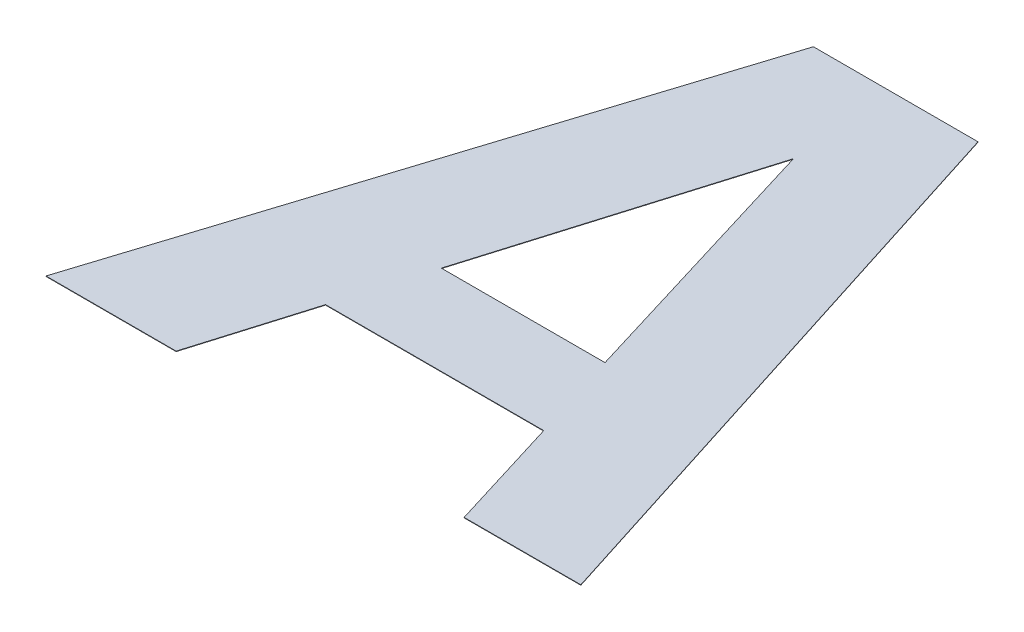
ISO-10303-21;
HEADER;
FILE_DESCRIPTION(('STEP AP214'),'2;1');
FILE_NAME('part.step','',(''),(''),'','','');
FILE_SCHEMA(('AUTOMOTIVE_DESIGN { 1 0 10303 214 1 1 1 1 }'));
ENDSEC;
DATA;
#1=APPLICATION_CONTEXT('core data for automotive mechanical design processes');
#2=APPLICATION_PROTOCOL_DEFINITION('international standard','automotive_design',2000,#1);
#3=PRODUCT_CONTEXT('',#1,'mechanical');
#4=PRODUCT('Part','Part','',(#3));
#5=PRODUCT_RELATED_PRODUCT_CATEGORY('part','',(#4));
#6=PRODUCT_DEFINITION_FORMATION('','',#4);
#7=PRODUCT_DEFINITION_CONTEXT('part definition',#1,'design');
#8=PRODUCT_DEFINITION('design','',#6,#7);
#9=PRODUCT_DEFINITION_SHAPE('','',#8);
#10=(LENGTH_UNIT() NAMED_UNIT(*) SI_UNIT(.MILLI.,.METRE.));
#11=(NAMED_UNIT(*) PLANE_ANGLE_UNIT() SI_UNIT($,.RADIAN.));
#12=(NAMED_UNIT(*) SI_UNIT($,.STERADIAN.) SOLID_ANGLE_UNIT());
#13=UNCERTAINTY_MEASURE_WITH_UNIT(LENGTH_MEASURE(1.E-05),#10,'distance_accuracy_value','');
#14=(GEOMETRIC_REPRESENTATION_CONTEXT(3) GLOBAL_UNCERTAINTY_ASSIGNED_CONTEXT((#13)) GLOBAL_UNIT_ASSIGNED_CONTEXT((#10,
#11,#12)) REPRESENTATION_CONTEXT('',''));
#15=CARTESIAN_POINT('',(0.,0.,0.));
#16=DIRECTION('',(0.,0.,1.));
#17=DIRECTION('',(1.,0.,0.));
#18=AXIS2_PLACEMENT_3D('',#15,#16,#17);
#19=CARTESIAN_POINT('',(26.67,0.00300000000000009,0.));
#20=DIRECTION('',(0.,1.,0.));
#21=DIRECTION('',(0.,0.,1.));
#22=AXIS2_PLACEMENT_3D('',#19,#20,#21);
#23=PLANE('',#22);
#24=DIRECTION('',(-0.290938970277883,0.,-0.956741613798441));
#25=VECTOR('',#24,1.);
#26=CARTESIAN_POINT('',(19.2164156567885,0.00300000000000009,-83.618416758954));
#27=LINE('',#26,#25);
#28=CARTESIAN_POINT('',(19.2164156567885,0.00300000000000009,-83.618416758954));
#29=VERTEX_POINT('',#28);
#30=CARTESIAN_POINT('',(19.4993446978223,0.00300000000000009,-82.6880154894006));
#31=VERTEX_POINT('',#30);
#32=EDGE_CURVE('E121',#29,#31,#27,.F.);
#33=ORIENTED_EDGE('',*,*,#32,.T.);
#34=DIRECTION('',(1.,0.,0.));
#35=VECTOR('',#34,1.);
#36=CARTESIAN_POINT('',(19.4993446978223,0.00300000000000009,-82.6880154894006));
#37=LINE('',#36,#35);
#38=CARTESIAN_POINT('',(18.9371139111526,0.00300000000000009,-82.6880154894006));
#39=VERTEX_POINT('',#38);
#40=EDGE_CURVE('E162',#31,#39,#37,.F.);
#41=ORIENTED_EDGE('',*,*,#40,.T.);
#42=DIRECTION('',(-0.287519166070125,0.,0.957774884376459));
#43=VECTOR('',#42,1.);
#44=CARTESIAN_POINT('',(18.9371139111526,0.00300000000000009,-82.6880154894006));
#45=LINE('',#44,#43);
#46=EDGE_CURVE('E158',#39,#29,#45,.F.);
#47=ORIENTED_EDGE('',*,*,#46,.T.);
#48=EDGE_LOOP('',(#33,#41,#47));
#49=FACE_BOUND('',#48,.T.);
#50=DIRECTION('',(1.,0.,0.));
#51=VECTOR('',#50,1.);
#52=CARTESIAN_POINT('',(19.4830218685319,0.00300000000000009,-83.9856804179882));
#53=LINE('',#52,#51);
#54=CARTESIAN_POINT('',(19.4830218685319,0.00300000000000009,-83.9856804179882));
#55=VERTEX_POINT('',#54);
#56=CARTESIAN_POINT('',(18.9176171983891,0.00300000000000009,-83.9856804179882));
#57=VERTEX_POINT('',#56);
#58=EDGE_CURVE('E136',#55,#57,#53,.F.);
#59=ORIENTED_EDGE('',*,*,#58,.T.);
#60=DIRECTION('',(0.303105565746836,0.,-0.952956985395086));
#61=VECTOR('',#60,1.);
#62=CARTESIAN_POINT('',(18.9176171983891,0.00300000000000009,-83.9856804179882));
#63=LINE('',#62,#61);
#64=CARTESIAN_POINT('',(18.2814802679878,0.00300000000000009,-81.9856804179882));
#65=VERTEX_POINT('',#64);
#66=EDGE_CURVE('E127',#57,#65,#63,.F.);
#67=ORIENTED_EDGE('',*,*,#66,.T.);
#68=DIRECTION('',(-1.,0.,0.));
#69=VECTOR('',#68,1.);
#70=CARTESIAN_POINT('',(18.2814802679878,0.00300000000000009,-81.9856804179882));
#71=LINE('',#70,#69);
#72=CARTESIAN_POINT('',(18.7285444257751,0.00300000000000009,-81.9856804179882));
#73=VERTEX_POINT('',#72);
#74=EDGE_CURVE('E164',#65,#73,#71,.F.);
#75=ORIENTED_EDGE('',*,*,#74,.T.);
#76=DIRECTION('',(-0.287045176736179,0.,0.957917045736475));
#77=VECTOR('',#76,1.);
#78=CARTESIAN_POINT('',(18.7285444257751,0.00300000000000009,-81.9856804179882));
#79=LINE('',#78,#77);
#80=CARTESIAN_POINT('',(18.8468849381306,0.00300000000000009,-82.3806022044312));
#81=VERTEX_POINT('',#80);
#82=EDGE_CURVE('E102',#73,#81,#79,.F.);
#83=ORIENTED_EDGE('',*,*,#82,.T.);
#84=DIRECTION('',(-1.,0.,0.));
#85=VECTOR('',#84,1.);
#86=CARTESIAN_POINT('',(18.8468849381306,0.00300000000000009,-82.3806022044312));
#87=LINE('',#86,#85);
#88=CARTESIAN_POINT('',(19.5963748497153,0.00300000000000009,-82.3806022044312));
#89=VERTEX_POINT('',#88);
#90=EDGE_CURVE('E99',#81,#89,#87,.F.);
#91=ORIENTED_EDGE('',*,*,#90,.T.);
#92=DIRECTION('',(-0.294085848837518,0.,-0.955779008721952));
#93=VECTOR('',#92,1.);
#94=CARTESIAN_POINT('',(19.5963748497153,0.00300000000000009,-82.3806022044312));
#95=LINE('',#94,#93);
#96=CARTESIAN_POINT('',(19.7178892455439,0.00300000000000009,-81.9856804179882));
#97=VERTEX_POINT('',#96);
#98=EDGE_CURVE('E151',#89,#97,#95,.F.);
#99=ORIENTED_EDGE('',*,*,#98,.T.);
#100=DIRECTION('',(-1.,0.,0.));
#101=VECTOR('',#100,1.);
#102=CARTESIAN_POINT('',(19.7178892455439,0.00300000000000009,-81.9856804179882));
#103=LINE('',#102,#101);
#104=CARTESIAN_POINT('',(20.1187053870084,0.00300000000000009,-81.9856804179882));
#105=VERTEX_POINT('',#104);
#106=EDGE_CURVE('E147',#97,#105,#103,.F.);
#107=ORIENTED_EDGE('',*,*,#106,.T.);
#108=DIRECTION('',(0.30290935378198,0.,0.953019371991663));
#109=VECTOR('',#108,1.);
#110=CARTESIAN_POINT('',(20.1187053870084,0.00300000000000009,-81.9856804179882));
#111=LINE('',#110,#109);
#112=EDGE_CURVE('E142',#105,#55,#111,.F.);
#113=ORIENTED_EDGE('',*,*,#112,.T.);
#114=EDGE_LOOP('',(#59,#67,#75,#83,#91,#99,#107,#113));
#115=FACE_BOUND('',#114,.T.);
#116=ADVANCED_FACE('F16',(#49,#115),#23,.T.);
#117=CARTESIAN_POINT('',(18.7285444257751,0.00300000000000009,-81.9856804179882));
#118=DIRECTION('',(-0.957917045736475,0.,-0.287045176736179));
#119=DIRECTION('',(-0.287045176736179,0.,0.957917045736475));
#120=AXIS2_PLACEMENT_3D('',#117,#118,#119);
#121=PLANE('',#120);
#122=DIRECTION('',(0.,1.,0.));
#123=VECTOR('',#122,1.);
#124=CARTESIAN_POINT('',(18.8468849381306,0.00300000000000009,-82.3806022044312));
#125=LINE('',#124,#123);
#126=CARTESIAN_POINT('',(18.8468849381306,0.00149999999999997,-82.3806022044312));
#127=VERTEX_POINT('',#126);
#128=EDGE_CURVE('E19',#127,#81,#125,.T.);
#129=ORIENTED_EDGE('',*,*,#128,.T.);
#130=ORIENTED_EDGE('',*,*,#82,.F.);
#131=DIRECTION('',(0.,1.,0.));
#132=VECTOR('',#131,1.);
#133=CARTESIAN_POINT('',(18.7285444257751,0.00300000000000009,-81.9856804179882));
#134=LINE('',#133,#132);
#135=CARTESIAN_POINT('',(18.7285444257751,0.00149999999999997,-81.9856804179882));
#136=VERTEX_POINT('',#135);
#137=EDGE_CURVE('E116',#73,#136,#134,.F.);
#138=ORIENTED_EDGE('',*,*,#137,.T.);
#139=DIRECTION('',(0.287045176736224,0.,-0.957917045736461));
#140=VECTOR('',#139,1.);
#141=CARTESIAN_POINT('',(18.7285444257751,0.00149999999999997,-81.9856804179882));
#142=LINE('',#141,#140);
#143=EDGE_CURVE('E108',#136,#127,#142,.T.);
#144=ORIENTED_EDGE('',*,*,#143,.T.);
#145=EDGE_LOOP('',(#129,#130,#138,#144));
#146=FACE_BOUND('',#145,.T.);
#147=ADVANCED_FACE('F114',(#146),#121,.F.);
#148=CARTESIAN_POINT('',(18.8468849381306,0.00300000000000009,-82.3806022044312));
#149=DIRECTION('',(0.,0.,-1.));
#150=DIRECTION('',(-1.,0.,0.));
#151=AXIS2_PLACEMENT_3D('',#148,#149,#150);
#152=PLANE('',#151);
#153=DIRECTION('',(0.,1.,0.));
#154=VECTOR('',#153,1.);
#155=CARTESIAN_POINT('',(19.5963748497153,0.00300000000000009,-82.3806022044312));
#156=LINE('',#155,#154);
#157=CARTESIAN_POINT('',(19.5963748497153,0.00149999999999997,-82.3806022044312));
#158=VERTEX_POINT('',#157);
#159=EDGE_CURVE('E152',#158,#89,#156,.T.);
#160=ORIENTED_EDGE('',*,*,#159,.T.);
#161=ORIENTED_EDGE('',*,*,#90,.F.);
#162=ORIENTED_EDGE('',*,*,#128,.F.);
#163=DIRECTION('',(1.,0.,0.));
#164=VECTOR('',#163,1.);
#165=CARTESIAN_POINT('',(26.67,0.00149999999999997,-82.3806022044312));
#166=LINE('',#165,#164);
#167=EDGE_CURVE('E98',#127,#158,#166,.T.);
#168=ORIENTED_EDGE('',*,*,#167,.T.);
#169=EDGE_LOOP('',(#160,#161,#162,#168));
#170=FACE_BOUND('',#169,.T.);
#171=ADVANCED_FACE('F97',(#170),#152,.F.);
#172=CARTESIAN_POINT('',(19.5963748497153,0.00300000000000009,-82.3806022044312));
#173=DIRECTION('',(0.955779008721952,0.,-0.294085848837518));
#174=DIRECTION('',(-0.294085848837518,0.,-0.955779008721952));
#175=AXIS2_PLACEMENT_3D('',#172,#173,#174);
#176=PLANE('',#175);
#177=DIRECTION('',(0.,1.,0.));
#178=VECTOR('',#177,1.);
#179=CARTESIAN_POINT('',(19.7178892455439,0.00300000000000009,-81.9856804179882));
#180=LINE('',#179,#178);
#181=CARTESIAN_POINT('',(19.7178892455439,0.00149999999999997,-81.9856804179882));
#182=VERTEX_POINT('',#181);
#183=EDGE_CURVE('E149',#182,#97,#180,.T.);
#184=ORIENTED_EDGE('',*,*,#183,.T.);
#185=ORIENTED_EDGE('',*,*,#98,.F.);
#186=ORIENTED_EDGE('',*,*,#159,.F.);
#187=DIRECTION('',(0.294085848837486,0.,0.955779008721962));
#188=VECTOR('',#187,1.);
#189=CARTESIAN_POINT('',(19.5963748497153,0.00149999999999997,-82.3806022044312));
#190=LINE('',#189,#188);
#191=EDGE_CURVE('E112',#158,#182,#190,.T.);
#192=ORIENTED_EDGE('',*,*,#191,.T.);
#193=EDGE_LOOP('',(#184,#185,#186,#192));
#194=FACE_BOUND('',#193,.T.);
#195=ADVANCED_FACE('F176',(#194),#176,.F.);
#196=CARTESIAN_POINT('',(19.7178892455439,0.00300000000000009,-81.9856804179882));
#197=DIRECTION('',(0.,0.,-1.));
#198=DIRECTION('',(-1.,0.,0.));
#199=AXIS2_PLACEMENT_3D('',#196,#197,#198);
#200=PLANE('',#199);
#201=DIRECTION('',(0.,1.,0.));
#202=VECTOR('',#201,1.);
#203=CARTESIAN_POINT('',(20.1187053870084,0.00300000000000009,-81.9856804179882));
#204=LINE('',#203,#202);
#205=CARTESIAN_POINT('',(20.1187053870084,0.00149999999999997,-81.9856804179882));
#206=VERTEX_POINT('',#205);
#207=EDGE_CURVE('E144',#206,#105,#204,.T.);
#208=ORIENTED_EDGE('',*,*,#207,.T.);
#209=ORIENTED_EDGE('',*,*,#106,.F.);
#210=ORIENTED_EDGE('',*,*,#183,.F.);
#211=DIRECTION('',(1.,0.,0.));
#212=VECTOR('',#211,1.);
#213=CARTESIAN_POINT('',(26.67,0.00149999999999997,-81.9856804179882));
#214=LINE('',#213,#212);
#215=EDGE_CURVE('E141',#182,#206,#214,.T.);
#216=ORIENTED_EDGE('',*,*,#215,.T.);
#217=EDGE_LOOP('',(#208,#209,#210,#216));
#218=FACE_BOUND('',#217,.T.);
#219=ADVANCED_FACE('F181',(#218),#200,.F.);
#220=CARTESIAN_POINT('',(20.1187053870084,0.00300000000000009,-81.9856804179882));
#221=DIRECTION('',(-0.953019371991663,0.,0.30290935378198));
#222=DIRECTION('',(0.30290935378198,0.,0.953019371991663));
#223=AXIS2_PLACEMENT_3D('',#220,#221,#222);
#224=PLANE('',#223);
#225=DIRECTION('',(0.,1.,0.));
#226=VECTOR('',#225,1.);
#227=CARTESIAN_POINT('',(19.4830218685319,0.00300000000000009,-83.9856804179882));
#228=LINE('',#227,#226);
#229=CARTESIAN_POINT('',(19.4830218685319,0.00149999999999997,-83.9856804179882));
#230=VERTEX_POINT('',#229);
#231=EDGE_CURVE('E138',#230,#55,#228,.T.);
#232=ORIENTED_EDGE('',*,*,#231,.T.);
#233=ORIENTED_EDGE('',*,*,#112,.F.);
#234=ORIENTED_EDGE('',*,*,#207,.F.);
#235=DIRECTION('',(-0.302909353781965,0.,-0.953019371991667));
#236=VECTOR('',#235,1.);
#237=CARTESIAN_POINT('',(20.1187053870084,0.00149999999999997,-81.9856804179882));
#238=LINE('',#237,#236);
#239=EDGE_CURVE('E135',#206,#230,#238,.T.);
#240=ORIENTED_EDGE('',*,*,#239,.T.);
#241=EDGE_LOOP('',(#232,#233,#234,#240));
#242=FACE_BOUND('',#241,.T.);
#243=ADVANCED_FACE('F184',(#242),#224,.F.);
#244=CARTESIAN_POINT('',(19.4830218685319,0.00300000000000009,-83.9856804179882));
#245=DIRECTION('',(0.,0.,1.));
#246=DIRECTION('',(1.,0.,0.));
#247=AXIS2_PLACEMENT_3D('',#244,#245,#246);
#248=PLANE('',#247);
#249=DIRECTION('',(0.,1.,0.));
#250=VECTOR('',#249,1.);
#251=CARTESIAN_POINT('',(18.9176171983891,0.00300000000000009,-83.9856804179882));
#252=LINE('',#251,#250);
#253=CARTESIAN_POINT('',(18.9176171983891,0.00149999999999997,-83.9856804179882));
#254=VERTEX_POINT('',#253);
#255=EDGE_CURVE('E130',#254,#57,#252,.T.);
#256=ORIENTED_EDGE('',*,*,#255,.T.);
#257=ORIENTED_EDGE('',*,*,#58,.F.);
#258=ORIENTED_EDGE('',*,*,#231,.F.);
#259=DIRECTION('',(1.,0.,0.));
#260=VECTOR('',#259,1.);
#261=CARTESIAN_POINT('',(26.67,0.00149999999999997,-83.9856804179882));
#262=LINE('',#261,#260);
#263=EDGE_CURVE('E131',#230,#254,#262,.F.);
#264=ORIENTED_EDGE('',*,*,#263,.T.);
#265=EDGE_LOOP('',(#256,#257,#258,#264));
#266=FACE_BOUND('',#265,.T.);
#267=ADVANCED_FACE('F188',(#266),#248,.F.);
#268=CARTESIAN_POINT('',(18.9176171983891,0.00300000000000009,-83.9856804179882));
#269=DIRECTION('',(0.952956985395086,0.,0.303105565746836));
#270=DIRECTION('',(0.303105565746836,0.,-0.952956985395086));
#271=AXIS2_PLACEMENT_3D('',#268,#269,#270);
#272=PLANE('',#271);
#273=DIRECTION('',(0.,1.,0.));
#274=VECTOR('',#273,1.);
#275=CARTESIAN_POINT('',(18.2814802679878,0.00300000000000009,-81.9856804179882));
#276=LINE('',#275,#274);
#277=CARTESIAN_POINT('',(18.2814802679878,0.00149999999999997,-81.9856804179882));
#278=VERTEX_POINT('',#277);
#279=EDGE_CURVE('E129',#278,#65,#276,.T.);
#280=ORIENTED_EDGE('',*,*,#279,.T.);
#281=ORIENTED_EDGE('',*,*,#66,.F.);
#282=ORIENTED_EDGE('',*,*,#255,.F.);
#283=DIRECTION('',(-0.30310556574685,0.,0.952956985395082));
#284=VECTOR('',#283,1.);
#285=CARTESIAN_POINT('',(18.9176171983891,0.00149999999999997,-83.9856804179882));
#286=LINE('',#285,#284);
#287=EDGE_CURVE('E134',#254,#278,#286,.T.);
#288=ORIENTED_EDGE('',*,*,#287,.T.);
#289=EDGE_LOOP('',(#280,#281,#282,#288));
#290=FACE_BOUND('',#289,.T.);
#291=ADVANCED_FACE('F194',(#290),#272,.F.);
#292=CARTESIAN_POINT('',(18.2814802679878,0.00300000000000009,-81.9856804179882));
#293=DIRECTION('',(0.,0.,-1.));
#294=DIRECTION('',(-1.,0.,0.));
#295=AXIS2_PLACEMENT_3D('',#292,#293,#294);
#296=PLANE('',#295);
#297=ORIENTED_EDGE('',*,*,#137,.F.);
#298=ORIENTED_EDGE('',*,*,#74,.F.);
#299=ORIENTED_EDGE('',*,*,#279,.F.);
#300=DIRECTION('',(1.,0.,0.));
#301=VECTOR('',#300,1.);
#302=CARTESIAN_POINT('',(26.67,0.00149999999999997,-81.9856804179882));
#303=LINE('',#302,#301);
#304=EDGE_CURVE('E125',#278,#136,#303,.T.);
#305=ORIENTED_EDGE('',*,*,#304,.T.);
#306=EDGE_LOOP('',(#297,#298,#299,#305));
#307=FACE_BOUND('',#306,.T.);
#308=ADVANCED_FACE('F196',(#307),#296,.F.);
#309=CARTESIAN_POINT('',(19.4993446978223,0.00300000000000009,-82.6880154894006));
#310=DIRECTION('',(0.,0.,1.));
#311=DIRECTION('',(1.,0.,0.));
#312=AXIS2_PLACEMENT_3D('',#309,#310,#311);
#313=PLANE('',#312);
#314=DIRECTION('',(0.,1.,0.));
#315=VECTOR('',#314,1.);
#316=CARTESIAN_POINT('',(18.9371139111526,0.00300000000000009,-82.6880154894006));
#317=LINE('',#316,#315);
#318=CARTESIAN_POINT('',(18.9371139111526,0.00149999999999997,-82.6880154894006));
#319=VERTEX_POINT('',#318);
#320=EDGE_CURVE('E159',#319,#39,#317,.T.);
#321=ORIENTED_EDGE('',*,*,#320,.T.);
#322=ORIENTED_EDGE('',*,*,#40,.F.);
#323=DIRECTION('',(0.,1.,0.));
#324=VECTOR('',#323,1.);
#325=CARTESIAN_POINT('',(19.4993446978223,0.00300000000000009,-82.6880154894006));
#326=LINE('',#325,#324);
#327=CARTESIAN_POINT('',(19.4993446978223,0.00149999999999997,-82.6880154894006));
#328=VERTEX_POINT('',#327);
#329=EDGE_CURVE('E118',#31,#328,#326,.F.);
#330=ORIENTED_EDGE('',*,*,#329,.T.);
#331=DIRECTION('',(1.,0.,0.));
#332=VECTOR('',#331,1.);
#333=CARTESIAN_POINT('',(26.67,0.00149999999999997,-82.6880154894006));
#334=LINE('',#333,#332);
#335=EDGE_CURVE('E197',#328,#319,#334,.F.);
#336=ORIENTED_EDGE('',*,*,#335,.T.);
#337=EDGE_LOOP('',(#321,#322,#330,#336));
#338=FACE_BOUND('',#337,.T.);
#339=ADVANCED_FACE('F218',(#338),#313,.F.);
#340=CARTESIAN_POINT('',(18.9371139111526,0.00300000000000009,-82.6880154894006));
#341=DIRECTION('',(-0.957774884376459,0.,-0.287519166070125));
#342=DIRECTION('',(-0.287519166070125,0.,0.957774884376459));
#343=AXIS2_PLACEMENT_3D('',#340,#341,#342);
#344=PLANE('',#343);
#345=DIRECTION('',(0.,1.,0.));
#346=VECTOR('',#345,1.);
#347=CARTESIAN_POINT('',(19.2164156567885,0.00300000000000009,-83.618416758954));
#348=LINE('',#347,#346);
#349=CARTESIAN_POINT('',(19.2164156567885,0.00149999999999997,-83.618416758954));
#350=VERTEX_POINT('',#349);
#351=EDGE_CURVE('E33',#350,#29,#348,.T.);
#352=ORIENTED_EDGE('',*,*,#351,.T.);
#353=ORIENTED_EDGE('',*,*,#46,.F.);
#354=ORIENTED_EDGE('',*,*,#320,.F.);
#355=DIRECTION('',(0.287519166070115,0.,-0.957774884376462));
#356=VECTOR('',#355,1.);
#357=CARTESIAN_POINT('',(18.9371139111526,0.00149999999999997,-82.6880154894006));
#358=LINE('',#357,#356);
#359=EDGE_CURVE('E25',#319,#350,#358,.T.);
#360=ORIENTED_EDGE('',*,*,#359,.T.);
#361=EDGE_LOOP('',(#352,#353,#354,#360));
#362=FACE_BOUND('',#361,.T.);
#363=ADVANCED_FACE('F213',(#362),#344,.F.);
#364=CARTESIAN_POINT('',(19.2164156567885,0.00300000000000009,-83.618416758954));
#365=DIRECTION('',(0.956741613798441,0.,-0.290938970277883));
#366=DIRECTION('',(-0.290938970277883,0.,-0.956741613798441));
#367=AXIS2_PLACEMENT_3D('',#364,#365,#366);
#368=PLANE('',#367);
#369=ORIENTED_EDGE('',*,*,#329,.F.);
#370=ORIENTED_EDGE('',*,*,#32,.F.);
#371=ORIENTED_EDGE('',*,*,#351,.F.);
#372=DIRECTION('',(0.290938970277906,0.,0.956741613798434));
#373=VECTOR('',#372,1.);
#374=CARTESIAN_POINT('',(19.2164156567885,0.00149999999999997,-83.618416758954));
#375=LINE('',#374,#373);
#376=EDGE_CURVE('E11',#350,#328,#375,.T.);
#377=ORIENTED_EDGE('',*,*,#376,.T.);
#378=EDGE_LOOP('',(#369,#370,#371,#377));
#379=FACE_BOUND('',#378,.T.);
#380=ADVANCED_FACE('F211',(#379),#368,.F.);
#381=CARTESIAN_POINT('',(26.67,0.00149999999999997,0.));
#382=DIRECTION('',(0.,1.,0.));
#383=DIRECTION('',(0.,0.,1.));
#384=AXIS2_PLACEMENT_3D('',#381,#382,#383);
#385=PLANE('',#384);
#386=ORIENTED_EDGE('',*,*,#359,.F.);
#387=ORIENTED_EDGE('',*,*,#335,.F.);
#388=ORIENTED_EDGE('',*,*,#376,.F.);
#389=EDGE_LOOP('',(#386,#387,#388));
#390=FACE_BOUND('',#389,.T.);
#391=ORIENTED_EDGE('',*,*,#287,.F.);
#392=ORIENTED_EDGE('',*,*,#263,.F.);
#393=ORIENTED_EDGE('',*,*,#239,.F.);
#394=ORIENTED_EDGE('',*,*,#215,.F.);
#395=ORIENTED_EDGE('',*,*,#191,.F.);
#396=ORIENTED_EDGE('',*,*,#167,.F.);
#397=ORIENTED_EDGE('',*,*,#143,.F.);
#398=ORIENTED_EDGE('',*,*,#304,.F.);
#399=EDGE_LOOP('',(#391,#392,#393,#394,#395,#396,#397,#398));
#400=FACE_BOUND('',#399,.T.);
#401=ADVANCED_FACE('F106',(#390,#400),#385,.F.);
#402=CLOSED_SHELL('',(#116,#147,#171,#195,#219,#243,#267,#291,#308,#339,#363,#380,#401));
#403=MANIFOLD_SOLID_BREP('B1',#402);
#404=ADVANCED_BREP_SHAPE_REPRESENTATION('',(#18,#403),#14);
#405=SHAPE_DEFINITION_REPRESENTATION(#9,#404);
ENDSEC;
END-ISO-10303-21;
